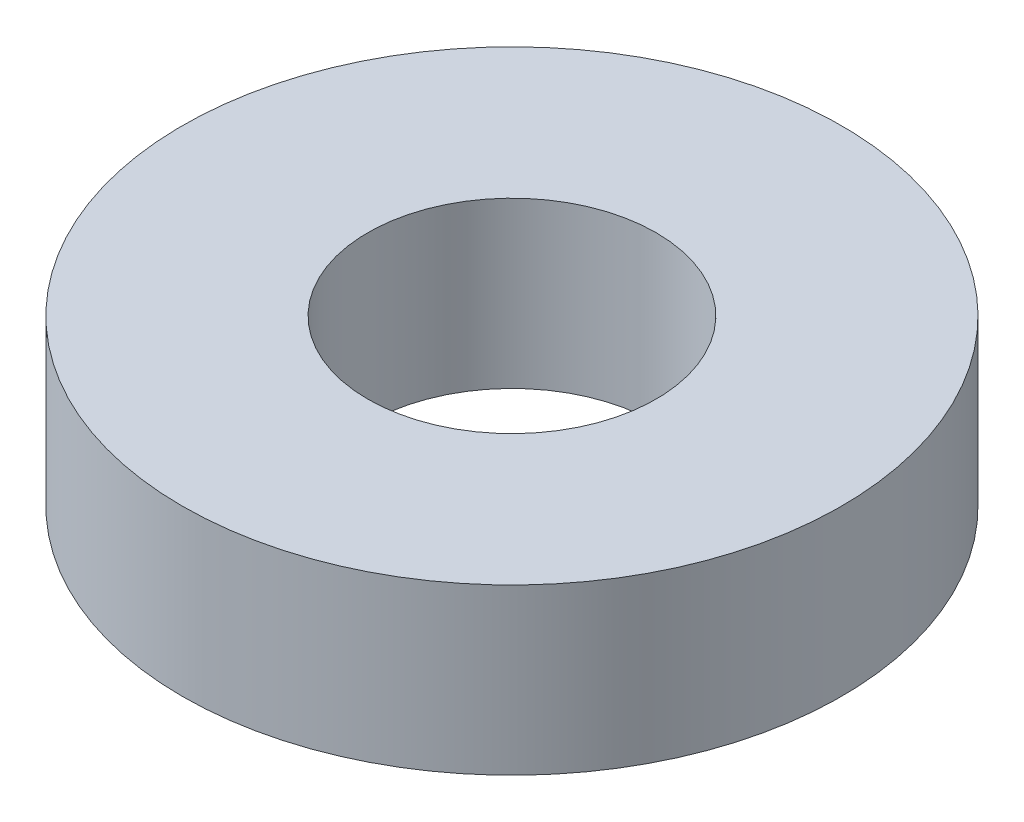
ISO-10303-21;
HEADER;
FILE_DESCRIPTION(('STEP AP214'),'2;1');
FILE_NAME('part.step','',(''),(''),'','','');
FILE_SCHEMA(('AUTOMOTIVE_DESIGN { 1 0 10303 214 1 1 1 1 }'));
ENDSEC;
DATA;
#1=APPLICATION_CONTEXT('core data for automotive mechanical design processes');
#2=APPLICATION_PROTOCOL_DEFINITION('international standard','automotive_design',2000,#1);
#3=PRODUCT_CONTEXT('',#1,'mechanical');
#4=PRODUCT('Part','Part','',(#3));
#5=PRODUCT_RELATED_PRODUCT_CATEGORY('part','',(#4));
#6=PRODUCT_DEFINITION_FORMATION('','',#4);
#7=PRODUCT_DEFINITION_CONTEXT('part definition',#1,'design');
#8=PRODUCT_DEFINITION('design','',#6,#7);
#9=PRODUCT_DEFINITION_SHAPE('','',#8);
#10=(LENGTH_UNIT() NAMED_UNIT(*) SI_UNIT(.MILLI.,.METRE.));
#11=(NAMED_UNIT(*) PLANE_ANGLE_UNIT() SI_UNIT($,.RADIAN.));
#12=(NAMED_UNIT(*) SI_UNIT($,.STERADIAN.) SOLID_ANGLE_UNIT());
#13=UNCERTAINTY_MEASURE_WITH_UNIT(LENGTH_MEASURE(1.E-05),#10,'distance_accuracy_value','');
#14=(GEOMETRIC_REPRESENTATION_CONTEXT(3) GLOBAL_UNCERTAINTY_ASSIGNED_CONTEXT((#13)) GLOBAL_UNIT_ASSIGNED_CONTEXT((#10,
#11,#12)) REPRESENTATION_CONTEXT('',''));
#15=CARTESIAN_POINT('',(0.,0.,0.));
#16=DIRECTION('',(0.,0.,1.));
#17=DIRECTION('',(1.,0.,0.));
#18=AXIS2_PLACEMENT_3D('',#15,#16,#17);
#19=CARTESIAN_POINT('',(0.,2.,0.));
#20=DIRECTION('',(0.,1.,0.));
#21=DIRECTION('',(0.,0.,1.));
#22=AXIS2_PLACEMENT_3D('',#19,#20,#21);
#23=PLANE('',#22);
#24=CARTESIAN_POINT('',(0.,2.,0.));
#25=DIRECTION('',(0.,1.,0.));
#26=DIRECTION('',(0.,0.,1.));
#27=AXIS2_PLACEMENT_3D('',#24,#25,#26);
#28=CIRCLE('',#27,4.);
#29=CARTESIAN_POINT('',(0.,2.,4.));
#30=VERTEX_POINT('',#29);
#31=EDGE_CURVE('E11',#30,#30,#28,.T.);
#32=ORIENTED_EDGE('',*,*,#31,.T.);
#33=EDGE_LOOP('',(#32));
#34=FACE_BOUND('',#33,.T.);
#35=CARTESIAN_POINT('',(0.,2.,0.));
#36=DIRECTION('',(0.,1.,0.));
#37=DIRECTION('',(0.,0.,1.));
#38=AXIS2_PLACEMENT_3D('',#35,#36,#37);
#39=CIRCLE('',#38,1.75);
#40=CARTESIAN_POINT('',(0.,2.,1.75));
#41=VERTEX_POINT('',#40);
#42=EDGE_CURVE('E47',#41,#41,#39,.T.);
#43=ORIENTED_EDGE('',*,*,#42,.F.);
#44=EDGE_LOOP('',(#43));
#45=FACE_BOUND('',#44,.T.);
#46=ADVANCED_FACE('F36',(#34,#45),#23,.T.);
#47=CARTESIAN_POINT('',(0.,0.,0.));
#48=DIRECTION('',(0.,1.,0.));
#49=DIRECTION('',(0.,0.,1.));
#50=AXIS2_PLACEMENT_3D('',#47,#48,#49);
#51=PLANE('',#50);
#52=CARTESIAN_POINT('',(0.,0.,0.));
#53=DIRECTION('',(0.,1.,0.));
#54=DIRECTION('',(0.,0.,1.));
#55=AXIS2_PLACEMENT_3D('',#52,#53,#54);
#56=CIRCLE('',#55,4.);
#57=CARTESIAN_POINT('',(0.,0.,4.));
#58=VERTEX_POINT('',#57);
#59=EDGE_CURVE('E40',#58,#58,#56,.T.);
#60=ORIENTED_EDGE('',*,*,#59,.F.);
#61=EDGE_LOOP('',(#60));
#62=FACE_BOUND('',#61,.T.);
#63=CARTESIAN_POINT('',(0.,0.,0.));
#64=DIRECTION('',(0.,1.,0.));
#65=DIRECTION('',(0.,0.,1.));
#66=AXIS2_PLACEMENT_3D('',#63,#64,#65);
#67=CIRCLE('',#66,1.75);
#68=CARTESIAN_POINT('',(0.,0.,1.75));
#69=VERTEX_POINT('',#68);
#70=EDGE_CURVE('E49',#69,#69,#67,.T.);
#71=ORIENTED_EDGE('',*,*,#70,.T.);
#72=EDGE_LOOP('',(#71));
#73=FACE_BOUND('',#72,.T.);
#74=ADVANCED_FACE('F59',(#62,#73),#51,.F.);
#75=CARTESIAN_POINT('',(0.,2.,0.));
#76=DIRECTION('',(0.,-1.,0.));
#77=DIRECTION('',(0.,0.,-1.));
#78=AXIS2_PLACEMENT_3D('',#75,#76,#77);
#79=CYLINDRICAL_SURFACE('',#78,4.);
#80=ORIENTED_EDGE('',*,*,#31,.F.);
#81=EDGE_LOOP('',(#80));
#82=FACE_BOUND('',#81,.T.);
#83=ORIENTED_EDGE('',*,*,#59,.T.);
#84=EDGE_LOOP('',(#83));
#85=FACE_BOUND('',#84,.T.);
#86=ADVANCED_FACE('F38',(#82,#85),#79,.T.);
#87=CARTESIAN_POINT('',(0.,2.,0.));
#88=DIRECTION('',(0.,-1.,0.));
#89=DIRECTION('',(0.,0.,-1.));
#90=AXIS2_PLACEMENT_3D('',#87,#88,#89);
#91=CYLINDRICAL_SURFACE('',#90,1.75);
#92=ORIENTED_EDGE('',*,*,#42,.T.);
#93=EDGE_LOOP('',(#92));
#94=FACE_BOUND('',#93,.T.);
#95=ORIENTED_EDGE('',*,*,#70,.F.);
#96=EDGE_LOOP('',(#95));
#97=FACE_BOUND('',#96,.T.);
#98=ADVANCED_FACE('F55',(#94,#97),#91,.F.);
#99=CLOSED_SHELL('',(#46,#74,#86,#98));
#100=MANIFOLD_SOLID_BREP('B2',#99);
#101=ADVANCED_BREP_SHAPE_REPRESENTATION('',(#18,#100),#14);
#102=SHAPE_DEFINITION_REPRESENTATION(#9,#101);
ENDSEC;
END-ISO-10303-21;
